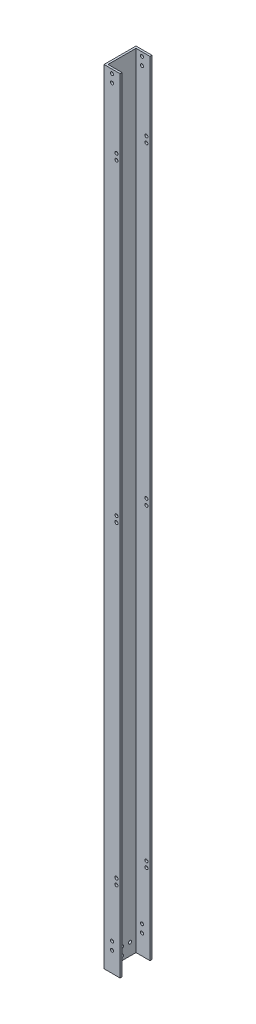
ISO-10303-21;
HEADER;
FILE_DESCRIPTION(('STEP AP214'),'2;1');
FILE_NAME('part.step','',(''),(''),'','','');
FILE_SCHEMA(('AUTOMOTIVE_DESIGN { 1 0 10303 214 1 1 1 1 }'));
ENDSEC;
DATA;
#1=APPLICATION_CONTEXT('core data for automotive mechanical design processes');
#2=APPLICATION_PROTOCOL_DEFINITION('international standard','automotive_design',2000,#1);
#3=PRODUCT_CONTEXT('',#1,'mechanical');
#4=PRODUCT('Part','Part','',(#3));
#5=PRODUCT_RELATED_PRODUCT_CATEGORY('part','',(#4));
#6=PRODUCT_DEFINITION_FORMATION('','',#4);
#7=PRODUCT_DEFINITION_CONTEXT('part definition',#1,'design');
#8=PRODUCT_DEFINITION('design','',#6,#7);
#9=PRODUCT_DEFINITION_SHAPE('','',#8);
#10=(LENGTH_UNIT() NAMED_UNIT(*) SI_UNIT(.MILLI.,.METRE.));
#11=(NAMED_UNIT(*) PLANE_ANGLE_UNIT() SI_UNIT($,.RADIAN.));
#12=(NAMED_UNIT(*) SI_UNIT($,.STERADIAN.) SOLID_ANGLE_UNIT());
#13=UNCERTAINTY_MEASURE_WITH_UNIT(LENGTH_MEASURE(1.E-05),#10,'distance_accuracy_value','');
#14=(GEOMETRIC_REPRESENTATION_CONTEXT(3) GLOBAL_UNCERTAINTY_ASSIGNED_CONTEXT((#13)) GLOBAL_UNIT_ASSIGNED_CONTEXT((#10,
#11,#12)) REPRESENTATION_CONTEXT('',''));
#15=CARTESIAN_POINT('',(0.,0.,0.));
#16=DIRECTION('',(0.,0.,1.));
#17=DIRECTION('',(1.,0.,0.));
#18=AXIS2_PLACEMENT_3D('',#15,#16,#17);
#19=CARTESIAN_POINT('',(25.4,1244.6,0.));
#20=DIRECTION('',(-1.,0.,0.));
#21=DIRECTION('',(0.,0.,1.));
#22=AXIS2_PLACEMENT_3D('',#19,#20,#21);
#23=PLANE('',#22);
#24=DIRECTION('',(0.,0.,-1.));
#25=VECTOR('',#24,1.);
#26=CARTESIAN_POINT('',(25.4,1244.6,0.));
#27=LINE('',#26,#25);
#28=CARTESIAN_POINT('',(25.4,1244.6,-47.625));
#29=VERTEX_POINT('',#28);
#30=CARTESIAN_POINT('',(25.4,1244.6,-50.8));
#31=VERTEX_POINT('',#30);
#32=EDGE_CURVE('E329',#29,#31,#27,.T.);
#33=ORIENTED_EDGE('',*,*,#32,.F.);
#34=DIRECTION('',(0.,1.,0.));
#35=VECTOR('',#34,1.);
#36=CARTESIAN_POINT('',(25.4,0.,-47.625));
#37=LINE('',#36,#35);
#38=CARTESIAN_POINT('',(25.4,0.,-47.625));
#39=VERTEX_POINT('',#38);
#40=EDGE_CURVE('E152',#39,#29,#37,.T.);
#41=ORIENTED_EDGE('',*,*,#40,.F.);
#42=DIRECTION('',(0.,0.,-1.));
#43=VECTOR('',#42,1.);
#44=CARTESIAN_POINT('',(25.4,0.,0.));
#45=LINE('',#44,#43);
#46=CARTESIAN_POINT('',(25.4,0.,-50.8));
#47=VERTEX_POINT('',#46);
#48=EDGE_CURVE('E157',#39,#47,#45,.T.);
#49=ORIENTED_EDGE('',*,*,#48,.T.);
#50=DIRECTION('',(0.,-1.,0.));
#51=VECTOR('',#50,1.);
#52=CARTESIAN_POINT('',(25.4,1244.6,-50.8));
#53=LINE('',#52,#51);
#54=EDGE_CURVE('E167',#31,#47,#53,.T.);
#55=ORIENTED_EDGE('',*,*,#54,.F.);
#56=EDGE_LOOP('',(#33,#41,#49,#55));
#57=FACE_BOUND('',#56,.T.);
#58=ADVANCED_FACE('F56',(#57),#23,.F.);
#59=CARTESIAN_POINT('',(0.,1244.6,0.));
#60=DIRECTION('',(0.,1.,0.));
#61=DIRECTION('',(0.,0.,1.));
#62=AXIS2_PLACEMENT_3D('',#59,#60,#61);
#63=PLANE('',#62);
#64=DIRECTION('',(-1.,0.,0.));
#65=VECTOR('',#64,1.);
#66=CARTESIAN_POINT('',(0.,1244.6,-47.625));
#67=LINE('',#66,#65);
#68=CARTESIAN_POINT('',(3.175,1244.6,-47.625));
#69=VERTEX_POINT('',#68);
#70=EDGE_CURVE('E318',#29,#69,#67,.T.);
#71=ORIENTED_EDGE('',*,*,#70,.F.);
#72=ORIENTED_EDGE('',*,*,#32,.T.);
#73=DIRECTION('',(-1.,0.,0.));
#74=VECTOR('',#73,1.);
#75=CARTESIAN_POINT('',(0.,1244.6,-50.8));
#76=LINE('',#75,#74);
#77=CARTESIAN_POINT('',(0.,1244.6,-50.8));
#78=VERTEX_POINT('',#77);
#79=EDGE_CURVE('E82',#31,#78,#76,.T.);
#80=ORIENTED_EDGE('',*,*,#79,.T.);
#81=DIRECTION('',(0.,0.,1.));
#82=VECTOR('',#81,1.);
#83=CARTESIAN_POINT('',(0.,1244.6,0.));
#84=LINE('',#83,#82);
#85=CARTESIAN_POINT('',(0.,1244.6,0.));
#86=VERTEX_POINT('',#85);
#87=EDGE_CURVE('E159',#78,#86,#84,.T.);
#88=ORIENTED_EDGE('',*,*,#87,.T.);
#89=DIRECTION('',(1.,0.,0.));
#90=VECTOR('',#89,1.);
#91=CARTESIAN_POINT('',(0.,1244.6,0.));
#92=LINE('',#91,#90);
#93=CARTESIAN_POINT('',(25.4,1244.6,0.));
#94=VERTEX_POINT('',#93);
#95=EDGE_CURVE('E110',#86,#94,#92,.T.);
#96=ORIENTED_EDGE('',*,*,#95,.T.);
#97=CARTESIAN_POINT('',(25.4,1244.6,-3.175));
#98=VERTEX_POINT('',#97);
#99=EDGE_CURVE('E330',#94,#98,#27,.T.);
#100=ORIENTED_EDGE('',*,*,#99,.T.);
#101=DIRECTION('',(1.,0.,0.));
#102=VECTOR('',#101,1.);
#103=CARTESIAN_POINT('',(0.,1244.6,-3.175));
#104=LINE('',#103,#102);
#105=CARTESIAN_POINT('',(3.175,1244.6,-3.175));
#106=VERTEX_POINT('',#105);
#107=EDGE_CURVE('E148',#106,#98,#104,.T.);
#108=ORIENTED_EDGE('',*,*,#107,.F.);
#109=DIRECTION('',(0.,0.,1.));
#110=VECTOR('',#109,1.);
#111=CARTESIAN_POINT('',(3.175,1244.6,0.));
#112=LINE('',#111,#110);
#113=EDGE_CURVE('E315',#69,#106,#112,.T.);
#114=ORIENTED_EDGE('',*,*,#113,.F.);
#115=EDGE_LOOP('',(#71,#72,#80,#88,#96,#100,#108,#114));
#116=FACE_BOUND('',#115,.T.);
#117=ADVANCED_FACE('F343',(#116),#63,.T.);
#118=CARTESIAN_POINT('',(0.,0.,0.));
#119=DIRECTION('',(0.,1.,0.));
#120=DIRECTION('',(0.,0.,1.));
#121=AXIS2_PLACEMENT_3D('',#118,#119,#120);
#122=PLANE('',#121);
#123=ORIENTED_EDGE('',*,*,#48,.F.);
#124=DIRECTION('',(-1.,0.,0.));
#125=VECTOR('',#124,1.);
#126=CARTESIAN_POINT('',(0.,0.,-47.625));
#127=LINE('',#126,#125);
#128=CARTESIAN_POINT('',(3.175,0.,-47.625));
#129=VERTEX_POINT('',#128);
#130=EDGE_CURVE('E142',#39,#129,#127,.T.);
#131=ORIENTED_EDGE('',*,*,#130,.T.);
#132=DIRECTION('',(0.,0.,1.));
#133=VECTOR('',#132,1.);
#134=CARTESIAN_POINT('',(3.175,0.,0.));
#135=LINE('',#134,#133);
#136=CARTESIAN_POINT('',(3.175,0.,-3.175));
#137=VERTEX_POINT('',#136);
#138=EDGE_CURVE('E73',#129,#137,#135,.T.);
#139=ORIENTED_EDGE('',*,*,#138,.T.);
#140=DIRECTION('',(1.,0.,0.));
#141=VECTOR('',#140,1.);
#142=CARTESIAN_POINT('',(0.,0.,-3.175));
#143=LINE('',#142,#141);
#144=CARTESIAN_POINT('',(25.4,0.,-3.175));
#145=VERTEX_POINT('',#144);
#146=EDGE_CURVE('E133',#137,#145,#143,.T.);
#147=ORIENTED_EDGE('',*,*,#146,.T.);
#148=CARTESIAN_POINT('',(25.4,0.,0.));
#149=VERTEX_POINT('',#148);
#150=EDGE_CURVE('E138',#149,#145,#45,.T.);
#151=ORIENTED_EDGE('',*,*,#150,.F.);
#152=DIRECTION('',(1.,0.,0.));
#153=VECTOR('',#152,1.);
#154=CARTESIAN_POINT('',(0.,0.,0.));
#155=LINE('',#154,#153);
#156=CARTESIAN_POINT('',(0.,0.,0.));
#157=VERTEX_POINT('',#156);
#158=EDGE_CURVE('E161',#157,#149,#155,.T.);
#159=ORIENTED_EDGE('',*,*,#158,.F.);
#160=DIRECTION('',(0.,0.,1.));
#161=VECTOR('',#160,1.);
#162=CARTESIAN_POINT('',(0.,0.,0.));
#163=LINE('',#162,#161);
#164=CARTESIAN_POINT('',(0.,0.,-50.8));
#165=VERTEX_POINT('',#164);
#166=EDGE_CURVE('E326',#165,#157,#163,.T.);
#167=ORIENTED_EDGE('',*,*,#166,.F.);
#168=DIRECTION('',(-1.,0.,0.));
#169=VECTOR('',#168,1.);
#170=CARTESIAN_POINT('',(0.,0.,-50.8));
#171=LINE('',#170,#169);
#172=EDGE_CURVE('E103',#47,#165,#171,.T.);
#173=ORIENTED_EDGE('',*,*,#172,.F.);
#174=EDGE_LOOP('',(#123,#131,#139,#147,#151,#159,#167,#173));
#175=FACE_BOUND('',#174,.T.);
#176=ADVANCED_FACE('F136',(#175),#122,.F.);
#177=CARTESIAN_POINT('',(0.,1244.6,0.));
#178=DIRECTION('',(1.,0.,0.));
#179=DIRECTION('',(0.,0.,-1.));
#180=AXIS2_PLACEMENT_3D('',#177,#178,#179);
#181=PLANE('',#180);
#182=CARTESIAN_POINT('',(0.,19.05,-12.7000000000056));
#183=DIRECTION('',(-1.,0.,0.));
#184=DIRECTION('',(0.,0.,1.));
#185=AXIS2_PLACEMENT_3D('',#182,#183,#184);
#186=CIRCLE('',#185,2.48919999999998);
#187=CARTESIAN_POINT('',(0.,19.05,-10.2108000000057));
#188=VERTEX_POINT('',#187);
#189=EDGE_CURVE('E302',#188,#188,#186,.T.);
#190=ORIENTED_EDGE('',*,*,#189,.F.);
#191=EDGE_LOOP('',(#190));
#192=FACE_BOUND('',#191,.T.);
#193=CARTESIAN_POINT('',(0.,19.0499999999999,-38.1000000000057));
#194=DIRECTION('',(-1.,0.,0.));
#195=DIRECTION('',(0.,0.,1.));
#196=AXIS2_PLACEMENT_3D('',#193,#194,#195);
#197=CIRCLE('',#196,2.4892);
#198=CARTESIAN_POINT('',(0.,19.0499999999999,-35.6108000000056));
#199=VERTEX_POINT('',#198);
#200=EDGE_CURVE('E306',#199,#199,#197,.T.);
#201=ORIENTED_EDGE('',*,*,#200,.F.);
#202=EDGE_LOOP('',(#201));
#203=FACE_BOUND('',#202,.T.);
#204=CARTESIAN_POINT('',(0.,6.34999999999994,-25.4000000000056));
#205=DIRECTION('',(-1.,0.,0.));
#206=DIRECTION('',(0.,0.,1.));
#207=AXIS2_PLACEMENT_3D('',#204,#205,#206);
#208=CIRCLE('',#207,2.4892);
#209=CARTESIAN_POINT('',(0.,6.34999999999994,-22.9108000000056));
#210=VERTEX_POINT('',#209);
#211=EDGE_CURVE('E303',#210,#210,#208,.T.);
#212=ORIENTED_EDGE('',*,*,#211,.F.);
#213=EDGE_LOOP('',(#212));
#214=FACE_BOUND('',#213,.T.);
#215=CARTESIAN_POINT('',(0.,19.0499999999999,-25.4000000000056));
#216=DIRECTION('',(-1.,0.,0.));
#217=DIRECTION('',(0.,0.,1.));
#218=AXIS2_PLACEMENT_3D('',#215,#216,#217);
#219=CIRCLE('',#218,2.4892);
#220=CARTESIAN_POINT('',(0.,19.0499999999999,-22.9108000000056));
#221=VERTEX_POINT('',#220);
#222=EDGE_CURVE('E174',#221,#221,#219,.T.);
#223=ORIENTED_EDGE('',*,*,#222,.F.);
#224=EDGE_LOOP('',(#223));
#225=FACE_BOUND('',#224,.T.);
#226=ORIENTED_EDGE('',*,*,#166,.T.);
#227=DIRECTION('',(0.,-1.,0.));
#228=VECTOR('',#227,1.);
#229=CARTESIAN_POINT('',(0.,1244.6,0.));
#230=LINE('',#229,#228);
#231=EDGE_CURVE('E12',#86,#157,#230,.T.);
#232=ORIENTED_EDGE('',*,*,#231,.F.);
#233=ORIENTED_EDGE('',*,*,#87,.F.);
#234=DIRECTION('',(0.,-1.,0.));
#235=VECTOR('',#234,1.);
#236=CARTESIAN_POINT('',(0.,1244.6,-50.8));
#237=LINE('',#236,#235);
#238=EDGE_CURVE('E165',#78,#165,#237,.T.);
#239=ORIENTED_EDGE('',*,*,#238,.T.);
#240=EDGE_LOOP('',(#226,#232,#233,#239));
#241=FACE_BOUND('',#240,.T.);
#242=ADVANCED_FACE('F58',(#192,#203,#214,#225,#241),#181,.F.);
#243=CARTESIAN_POINT('',(0.,1244.6,0.));
#244=DIRECTION('',(0.,0.,-1.));
#245=DIRECTION('',(-1.,0.,0.));
#246=AXIS2_PLACEMENT_3D('',#243,#244,#245);
#247=PLANE('',#246);
#248=CARTESIAN_POINT('',(19.6850000000001,633.4125,0.));
#249=DIRECTION('',(0.,0.,-1.));
#250=DIRECTION('',(-1.,0.,0.));
#251=AXIS2_PLACEMENT_3D('',#248,#249,#250);
#252=CIRCLE('',#251,2.48919999999993);
#253=CARTESIAN_POINT('',(17.1958000000002,633.4125,0.));
#254=VERTEX_POINT('',#253);
#255=EDGE_CURVE('E221',#254,#254,#252,.T.);
#256=ORIENTED_EDGE('',*,*,#255,.T.);
#257=EDGE_LOOP('',(#256));
#258=FACE_BOUND('',#257,.T.);
#259=CARTESIAN_POINT('',(19.6850000000001,623.8875,0.));
#260=DIRECTION('',(0.,0.,-1.));
#261=DIRECTION('',(-1.,0.,0.));
#262=AXIS2_PLACEMENT_3D('',#259,#260,#261);
#263=CIRCLE('',#262,2.48919999999994);
#264=CARTESIAN_POINT('',(17.1958000000002,623.8875,0.));
#265=VERTEX_POINT('',#264);
#266=EDGE_CURVE('E232',#265,#265,#263,.T.);
#267=ORIENTED_EDGE('',*,*,#266,.T.);
#268=EDGE_LOOP('',(#267));
#269=FACE_BOUND('',#268,.T.);
#270=CARTESIAN_POINT('',(19.6850000000006,1132.205,0.));
#271=DIRECTION('',(0.,0.,-1.));
#272=DIRECTION('',(-1.,0.,0.));
#273=AXIS2_PLACEMENT_3D('',#270,#271,#272);
#274=CIRCLE('',#273,2.48919999999847);
#275=CARTESIAN_POINT('',(17.1958000000022,1132.205,0.));
#276=VERTEX_POINT('',#275);
#277=EDGE_CURVE('E268',#276,#276,#274,.T.);
#278=ORIENTED_EDGE('',*,*,#277,.T.);
#279=EDGE_LOOP('',(#278));
#280=FACE_BOUND('',#279,.T.);
#281=CARTESIAN_POINT('',(19.6850000000001,134.62,0.));
#282=DIRECTION('',(0.,0.,-1.));
#283=DIRECTION('',(-1.,0.,0.));
#284=AXIS2_PLACEMENT_3D('',#281,#282,#283);
#285=CIRCLE('',#284,2.48920000000062);
#286=CARTESIAN_POINT('',(17.1957999999994,134.62,0.));
#287=VERTEX_POINT('',#286);
#288=EDGE_CURVE('E217',#287,#287,#285,.T.);
#289=ORIENTED_EDGE('',*,*,#288,.T.);
#290=EDGE_LOOP('',(#289));
#291=FACE_BOUND('',#290,.T.);
#292=CARTESIAN_POINT('',(19.6850000000001,125.095,0.));
#293=DIRECTION('',(0.,0.,-1.));
#294=DIRECTION('',(-1.,0.,0.));
#295=AXIS2_PLACEMENT_3D('',#292,#293,#294);
#296=CIRCLE('',#295,2.4891999999997);
#297=CARTESIAN_POINT('',(17.1958000000004,125.095,0.));
#298=VERTEX_POINT('',#297);
#299=EDGE_CURVE('E213',#298,#298,#296,.T.);
#300=ORIENTED_EDGE('',*,*,#299,.T.);
#301=EDGE_LOOP('',(#300));
#302=FACE_BOUND('',#301,.T.);
#303=CARTESIAN_POINT('',(19.6850000000006,1122.68,0.));
#304=DIRECTION('',(0.,0.,-1.));
#305=DIRECTION('',(-1.,0.,0.));
#306=AXIS2_PLACEMENT_3D('',#303,#304,#305);
#307=CIRCLE('',#306,2.48919999999847);
#308=CARTESIAN_POINT('',(17.1958000000022,1122.68,0.));
#309=VERTEX_POINT('',#308);
#310=EDGE_CURVE('E208',#309,#309,#307,.T.);
#311=ORIENTED_EDGE('',*,*,#310,.T.);
#312=EDGE_LOOP('',(#311));
#313=FACE_BOUND('',#312,.T.);
#314=CARTESIAN_POINT('',(12.7000000000001,31.75,0.));
#315=DIRECTION('',(0.,0.,1.));
#316=DIRECTION('',(1.,0.,0.));
#317=AXIS2_PLACEMENT_3D('',#314,#315,#316);
#318=CIRCLE('',#317,2.4892);
#319=CARTESIAN_POINT('',(15.1892000000001,31.75,0.));
#320=VERTEX_POINT('',#319);
#321=EDGE_CURVE('E282',#320,#320,#318,.T.);
#322=ORIENTED_EDGE('',*,*,#321,.F.);
#323=EDGE_LOOP('',(#322));
#324=FACE_BOUND('',#323,.T.);
#325=CARTESIAN_POINT('',(12.7,1238.25,0.));
#326=DIRECTION('',(0.,0.,1.));
#327=DIRECTION('',(1.,0.,0.));
#328=AXIS2_PLACEMENT_3D('',#325,#326,#327);
#329=CIRCLE('',#328,2.48920000000005);
#330=CARTESIAN_POINT('',(15.1892000000001,1238.25,0.));
#331=VERTEX_POINT('',#330);
#332=EDGE_CURVE('E275',#331,#331,#329,.T.);
#333=ORIENTED_EDGE('',*,*,#332,.F.);
#334=EDGE_LOOP('',(#333));
#335=FACE_BOUND('',#334,.T.);
#336=CARTESIAN_POINT('',(12.7,1225.55,0.));
#337=DIRECTION('',(0.,0.,1.));
#338=DIRECTION('',(1.,0.,0.));
#339=AXIS2_PLACEMENT_3D('',#336,#337,#338);
#340=CIRCLE('',#339,2.48920000000004);
#341=CARTESIAN_POINT('',(15.1892,1225.55,0.));
#342=VERTEX_POINT('',#341);
#343=EDGE_CURVE('E271',#342,#342,#340,.T.);
#344=ORIENTED_EDGE('',*,*,#343,.F.);
#345=EDGE_LOOP('',(#344));
#346=FACE_BOUND('',#345,.T.);
#347=CARTESIAN_POINT('',(12.7,44.45,0.));
#348=DIRECTION('',(0.,0.,1.));
#349=DIRECTION('',(1.,0.,0.));
#350=AXIS2_PLACEMENT_3D('',#347,#348,#349);
#351=CIRCLE('',#350,2.4892);
#352=CARTESIAN_POINT('',(15.1892,44.45,0.));
#353=VERTEX_POINT('',#352);
#354=EDGE_CURVE('E281',#353,#353,#351,.T.);
#355=ORIENTED_EDGE('',*,*,#354,.F.);
#356=EDGE_LOOP('',(#355));
#357=FACE_BOUND('',#356,.T.);
#358=ORIENTED_EDGE('',*,*,#158,.T.);
#359=DIRECTION('',(0.,-1.,0.));
#360=VECTOR('',#359,1.);
#361=CARTESIAN_POINT('',(25.4,1244.6,0.));
#362=LINE('',#361,#360);
#363=EDGE_CURVE('E65',#94,#149,#362,.T.);
#364=ORIENTED_EDGE('',*,*,#363,.F.);
#365=ORIENTED_EDGE('',*,*,#95,.F.);
#366=ORIENTED_EDGE('',*,*,#231,.T.);
#367=EDGE_LOOP('',(#358,#364,#365,#366));
#368=FACE_BOUND('',#367,.T.);
#369=ADVANCED_FACE('F336',(#258,#269,#280,#291,#302,#313,#324,#335,#346,#357,#368),#247,.F.);
#370=ORIENTED_EDGE('',*,*,#150,.T.);
#371=DIRECTION('',(0.,1.,0.));
#372=VECTOR('',#371,1.);
#373=CARTESIAN_POINT('',(25.4,0.,-3.175));
#374=LINE('',#373,#372);
#375=EDGE_CURVE('E145',#145,#98,#374,.T.);
#376=ORIENTED_EDGE('',*,*,#375,.T.);
#377=ORIENTED_EDGE('',*,*,#99,.F.);
#378=ORIENTED_EDGE('',*,*,#363,.T.);
#379=EDGE_LOOP('',(#370,#376,#377,#378));
#380=FACE_BOUND('',#379,.T.);
#381=ADVANCED_FACE('F156',(#380),#23,.F.);
#382=CARTESIAN_POINT('',(0.,1244.6,-50.8));
#383=DIRECTION('',(0.,0.,1.));
#384=DIRECTION('',(1.,0.,0.));
#385=AXIS2_PLACEMENT_3D('',#382,#383,#384);
#386=PLANE('',#385);
#387=CARTESIAN_POINT('',(19.6850000000001,633.4125,-50.8));
#388=DIRECTION('',(0.,0.,-1.));
#389=DIRECTION('',(-1.,0.,0.));
#390=AXIS2_PLACEMENT_3D('',#387,#388,#389);
#391=CIRCLE('',#390,2.48919999999993);
#392=CARTESIAN_POINT('',(17.1958000000002,633.4125,-50.8));
#393=VERTEX_POINT('',#392);
#394=EDGE_CURVE('E227',#393,#393,#391,.T.);
#395=ORIENTED_EDGE('',*,*,#394,.F.);
#396=EDGE_LOOP('',(#395));
#397=FACE_BOUND('',#396,.T.);
#398=CARTESIAN_POINT('',(19.6850000000001,623.8875,-50.8));
#399=DIRECTION('',(0.,0.,-1.));
#400=DIRECTION('',(-1.,0.,0.));
#401=AXIS2_PLACEMENT_3D('',#398,#399,#400);
#402=CIRCLE('',#401,2.48919999999994);
#403=CARTESIAN_POINT('',(17.1958000000002,623.8875,-50.8));
#404=VERTEX_POINT('',#403);
#405=EDGE_CURVE('E237',#404,#404,#402,.T.);
#406=ORIENTED_EDGE('',*,*,#405,.F.);
#407=EDGE_LOOP('',(#406));
#408=FACE_BOUND('',#407,.T.);
#409=CARTESIAN_POINT('',(19.6850000000006,1132.205,-50.8));
#410=DIRECTION('',(0.,0.,1.));
#411=DIRECTION('',(1.,0.,0.));
#412=AXIS2_PLACEMENT_3D('',#409,#410,#411);
#413=CIRCLE('',#412,2.48919999999847);
#414=CARTESIAN_POINT('',(22.1741999999991,1132.205,-50.8));
#415=VERTEX_POINT('',#414);
#416=EDGE_CURVE('E203',#415,#415,#413,.T.);
#417=ORIENTED_EDGE('',*,*,#416,.T.);
#418=EDGE_LOOP('',(#417));
#419=FACE_BOUND('',#418,.T.);
#420=CARTESIAN_POINT('',(19.6850000000001,134.62,-50.8));
#421=DIRECTION('',(0.,0.,1.));
#422=DIRECTION('',(1.,0.,0.));
#423=AXIS2_PLACEMENT_3D('',#420,#421,#422);
#424=CIRCLE('',#423,2.48920000000062);
#425=CARTESIAN_POINT('',(22.1742000000007,134.62,-50.8));
#426=VERTEX_POINT('',#425);
#427=EDGE_CURVE('E246',#426,#426,#424,.T.);
#428=ORIENTED_EDGE('',*,*,#427,.T.);
#429=EDGE_LOOP('',(#428));
#430=FACE_BOUND('',#429,.T.);
#431=CARTESIAN_POINT('',(19.6850000000001,125.095,-50.8));
#432=DIRECTION('',(0.,0.,1.));
#433=DIRECTION('',(1.,0.,0.));
#434=AXIS2_PLACEMENT_3D('',#431,#432,#433);
#435=CIRCLE('',#434,2.4891999999997);
#436=CARTESIAN_POINT('',(22.1741999999998,125.095,-50.8));
#437=VERTEX_POINT('',#436);
#438=EDGE_CURVE('E249',#437,#437,#435,.T.);
#439=ORIENTED_EDGE('',*,*,#438,.T.);
#440=EDGE_LOOP('',(#439));
#441=FACE_BOUND('',#440,.T.);
#442=CARTESIAN_POINT('',(19.6850000000006,1122.68,-50.8));
#443=DIRECTION('',(0.,0.,1.));
#444=DIRECTION('',(1.,0.,0.));
#445=AXIS2_PLACEMENT_3D('',#442,#443,#444);
#446=CIRCLE('',#445,2.48919999999847);
#447=CARTESIAN_POINT('',(22.1741999999991,1122.68,-50.8));
#448=VERTEX_POINT('',#447);
#449=EDGE_CURVE('E243',#448,#448,#446,.T.);
#450=ORIENTED_EDGE('',*,*,#449,.T.);
#451=EDGE_LOOP('',(#450));
#452=FACE_BOUND('',#451,.T.);
#453=CARTESIAN_POINT('',(12.7000000000001,31.75,-50.8));
#454=DIRECTION('',(0.,0.,1.));
#455=DIRECTION('',(1.,0.,0.));
#456=AXIS2_PLACEMENT_3D('',#453,#454,#455);
#457=CIRCLE('',#456,2.4892);
#458=CARTESIAN_POINT('',(15.1892000000001,31.75,-50.8));
#459=VERTEX_POINT('',#458);
#460=EDGE_CURVE('E278',#459,#459,#457,.T.);
#461=ORIENTED_EDGE('',*,*,#460,.T.);
#462=EDGE_LOOP('',(#461));
#463=FACE_BOUND('',#462,.T.);
#464=CARTESIAN_POINT('',(12.7,1238.25,-50.8));
#465=DIRECTION('',(0.,0.,1.));
#466=DIRECTION('',(1.,0.,0.));
#467=AXIS2_PLACEMENT_3D('',#464,#465,#466);
#468=CIRCLE('',#467,2.48920000000005);
#469=CARTESIAN_POINT('',(15.1892000000001,1238.25,-50.8));
#470=VERTEX_POINT('',#469);
#471=EDGE_CURVE('E285',#470,#470,#468,.T.);
#472=ORIENTED_EDGE('',*,*,#471,.T.);
#473=EDGE_LOOP('',(#472));
#474=FACE_BOUND('',#473,.T.);
#475=CARTESIAN_POINT('',(12.7,1225.55,-50.8));
#476=DIRECTION('',(0.,0.,1.));
#477=DIRECTION('',(1.,0.,0.));
#478=AXIS2_PLACEMENT_3D('',#475,#476,#477);
#479=CIRCLE('',#478,2.48920000000004);
#480=CARTESIAN_POINT('',(15.1892,1225.55,-50.8));
#481=VERTEX_POINT('',#480);
#482=EDGE_CURVE('E272',#481,#481,#479,.T.);
#483=ORIENTED_EDGE('',*,*,#482,.T.);
#484=EDGE_LOOP('',(#483));
#485=FACE_BOUND('',#484,.T.);
#486=CARTESIAN_POINT('',(12.7,44.45,-50.8));
#487=DIRECTION('',(0.,0.,1.));
#488=DIRECTION('',(1.,0.,0.));
#489=AXIS2_PLACEMENT_3D('',#486,#487,#488);
#490=CIRCLE('',#489,2.4892);
#491=CARTESIAN_POINT('',(15.1892,44.45,-50.8));
#492=VERTEX_POINT('',#491);
#493=EDGE_CURVE('E186',#492,#492,#490,.T.);
#494=ORIENTED_EDGE('',*,*,#493,.T.);
#495=EDGE_LOOP('',(#494));
#496=FACE_BOUND('',#495,.T.);
#497=ORIENTED_EDGE('',*,*,#172,.T.);
#498=ORIENTED_EDGE('',*,*,#238,.F.);
#499=ORIENTED_EDGE('',*,*,#79,.F.);
#500=ORIENTED_EDGE('',*,*,#54,.T.);
#501=EDGE_LOOP('',(#497,#498,#499,#500));
#502=FACE_BOUND('',#501,.T.);
#503=ADVANCED_FACE('F341',(#397,#408,#419,#430,#441,#452,#463,#474,#485,#496,#502),#386,.F.);
#504=CARTESIAN_POINT('',(3.175,1244.6,0.));
#505=DIRECTION('',(1.,0.,0.));
#506=DIRECTION('',(0.,0.,-1.));
#507=AXIS2_PLACEMENT_3D('',#504,#505,#506);
#508=PLANE('',#507);
#509=CARTESIAN_POINT('',(3.175,19.05,-12.7000000000056));
#510=DIRECTION('',(1.,0.,0.));
#511=DIRECTION('',(0.,0.,-1.));
#512=AXIS2_PLACEMENT_3D('',#509,#510,#511);
#513=CIRCLE('',#512,2.48919999999998);
#514=CARTESIAN_POINT('',(3.175,19.05,-15.1892000000056));
#515=VERTEX_POINT('',#514);
#516=EDGE_CURVE('E153',#515,#515,#513,.T.);
#517=ORIENTED_EDGE('',*,*,#516,.F.);
#518=EDGE_LOOP('',(#517));
#519=FACE_BOUND('',#518,.T.);
#520=CARTESIAN_POINT('',(3.175,19.0499999999999,-38.1000000000057));
#521=DIRECTION('',(1.,0.,0.));
#522=DIRECTION('',(0.,0.,-1.));
#523=AXIS2_PLACEMENT_3D('',#520,#521,#522);
#524=CIRCLE('',#523,2.4892);
#525=CARTESIAN_POINT('',(3.175,19.0499999999999,-40.5892000000057));
#526=VERTEX_POINT('',#525);
#527=EDGE_CURVE('E177',#526,#526,#524,.T.);
#528=ORIENTED_EDGE('',*,*,#527,.F.);
#529=EDGE_LOOP('',(#528));
#530=FACE_BOUND('',#529,.T.);
#531=CARTESIAN_POINT('',(3.175,6.34999999999994,-25.4000000000056));
#532=DIRECTION('',(1.,0.,0.));
#533=DIRECTION('',(0.,0.,-1.));
#534=AXIS2_PLACEMENT_3D('',#531,#532,#533);
#535=CIRCLE('',#534,2.4892);
#536=CARTESIAN_POINT('',(3.175,6.34999999999994,-27.8892000000056));
#537=VERTEX_POINT('',#536);
#538=EDGE_CURVE('E173',#537,#537,#535,.T.);
#539=ORIENTED_EDGE('',*,*,#538,.F.);
#540=EDGE_LOOP('',(#539));
#541=FACE_BOUND('',#540,.T.);
#542=CARTESIAN_POINT('',(3.175,19.0499999999999,-25.4000000000056));
#543=DIRECTION('',(1.,0.,0.));
#544=DIRECTION('',(0.,0.,-1.));
#545=AXIS2_PLACEMENT_3D('',#542,#543,#544);
#546=CIRCLE('',#545,2.4892);
#547=CARTESIAN_POINT('',(3.175,19.0499999999999,-27.8892000000056));
#548=VERTEX_POINT('',#547);
#549=EDGE_CURVE('E170',#548,#548,#546,.T.);
#550=ORIENTED_EDGE('',*,*,#549,.F.);
#551=EDGE_LOOP('',(#550));
#552=FACE_BOUND('',#551,.T.);
#553=ORIENTED_EDGE('',*,*,#138,.F.);
#554=DIRECTION('',(0.,-1.,0.));
#555=VECTOR('',#554,1.);
#556=CARTESIAN_POINT('',(3.175,1244.6,-47.625));
#557=LINE('',#556,#555);
#558=EDGE_CURVE('E320',#69,#129,#557,.T.);
#559=ORIENTED_EDGE('',*,*,#558,.F.);
#560=ORIENTED_EDGE('',*,*,#113,.T.);
#561=DIRECTION('',(0.,-1.,0.));
#562=VECTOR('',#561,1.);
#563=CARTESIAN_POINT('',(3.175,1244.6,-3.175));
#564=LINE('',#563,#562);
#565=EDGE_CURVE('E324',#106,#137,#564,.T.);
#566=ORIENTED_EDGE('',*,*,#565,.T.);
#567=EDGE_LOOP('',(#553,#559,#560,#566));
#568=FACE_BOUND('',#567,.T.);
#569=ADVANCED_FACE('F345',(#519,#530,#541,#552,#568),#508,.T.);
#570=CARTESIAN_POINT('',(0.,1244.6,-3.175));
#571=DIRECTION('',(0.,0.,-1.));
#572=DIRECTION('',(-1.,0.,0.));
#573=AXIS2_PLACEMENT_3D('',#570,#571,#572);
#574=PLANE('',#573);
#575=CARTESIAN_POINT('',(19.6850000000001,633.4125,-3.175));
#576=DIRECTION('',(0.,0.,-1.));
#577=DIRECTION('',(-1.,0.,0.));
#578=AXIS2_PLACEMENT_3D('',#575,#576,#577);
#579=CIRCLE('',#578,2.48919999999993);
#580=CARTESIAN_POINT('',(17.1958000000002,633.4125,-3.175));
#581=VERTEX_POINT('',#580);
#582=EDGE_CURVE('E240',#581,#581,#579,.T.);
#583=ORIENTED_EDGE('',*,*,#582,.F.);
#584=EDGE_LOOP('',(#583));
#585=FACE_BOUND('',#584,.T.);
#586=CARTESIAN_POINT('',(19.6850000000001,623.8875,-3.175));
#587=DIRECTION('',(0.,0.,-1.));
#588=DIRECTION('',(-1.,0.,0.));
#589=AXIS2_PLACEMENT_3D('',#586,#587,#588);
#590=CIRCLE('',#589,2.48919999999994);
#591=CARTESIAN_POINT('',(17.1958000000002,623.8875,-3.175));
#592=VERTEX_POINT('',#591);
#593=EDGE_CURVE('E220',#592,#592,#590,.T.);
#594=ORIENTED_EDGE('',*,*,#593,.F.);
#595=EDGE_LOOP('',(#594));
#596=FACE_BOUND('',#595,.T.);
#597=CARTESIAN_POINT('',(19.6850000000006,1132.205,-3.175));
#598=DIRECTION('',(0.,0.,-1.));
#599=DIRECTION('',(-1.,0.,0.));
#600=AXIS2_PLACEMENT_3D('',#597,#598,#599);
#601=CIRCLE('',#600,2.48919999999847);
#602=CARTESIAN_POINT('',(17.1958000000022,1132.205,-3.175));
#603=VERTEX_POINT('',#602);
#604=EDGE_CURVE('E216',#603,#603,#601,.T.);
#605=ORIENTED_EDGE('',*,*,#604,.F.);
#606=EDGE_LOOP('',(#605));
#607=FACE_BOUND('',#606,.T.);
#608=CARTESIAN_POINT('',(19.6850000000001,134.62,-3.175));
#609=DIRECTION('',(0.,0.,-1.));
#610=DIRECTION('',(-1.,0.,0.));
#611=AXIS2_PLACEMENT_3D('',#608,#609,#610);
#612=CIRCLE('',#611,2.48920000000062);
#613=CARTESIAN_POINT('',(17.1957999999994,134.62,-3.175));
#614=VERTEX_POINT('',#613);
#615=EDGE_CURVE('E212',#614,#614,#612,.T.);
#616=ORIENTED_EDGE('',*,*,#615,.F.);
#617=EDGE_LOOP('',(#616));
#618=FACE_BOUND('',#617,.T.);
#619=CARTESIAN_POINT('',(19.6850000000001,125.095,-3.175));
#620=DIRECTION('',(0.,0.,-1.));
#621=DIRECTION('',(-1.,0.,0.));
#622=AXIS2_PLACEMENT_3D('',#619,#620,#621);
#623=CIRCLE('',#622,2.4891999999997);
#624=CARTESIAN_POINT('',(17.1958000000004,125.095,-3.175));
#625=VERTEX_POINT('',#624);
#626=EDGE_CURVE('E207',#625,#625,#623,.T.);
#627=ORIENTED_EDGE('',*,*,#626,.F.);
#628=EDGE_LOOP('',(#627));
#629=FACE_BOUND('',#628,.T.);
#630=CARTESIAN_POINT('',(19.6850000000006,1122.68,-3.175));
#631=DIRECTION('',(0.,0.,-1.));
#632=DIRECTION('',(-1.,0.,0.));
#633=AXIS2_PLACEMENT_3D('',#630,#631,#632);
#634=CIRCLE('',#633,2.48919999999847);
#635=CARTESIAN_POINT('',(17.1958000000022,1122.68,-3.175));
#636=VERTEX_POINT('',#635);
#637=EDGE_CURVE('E202',#636,#636,#634,.T.);
#638=ORIENTED_EDGE('',*,*,#637,.F.);
#639=EDGE_LOOP('',(#638));
#640=FACE_BOUND('',#639,.T.);
#641=CARTESIAN_POINT('',(12.7000000000001,31.75,-3.175));
#642=DIRECTION('',(0.,0.,-1.));
#643=DIRECTION('',(-1.,0.,0.));
#644=AXIS2_PLACEMENT_3D('',#641,#642,#643);
#645=CIRCLE('',#644,2.4892);
#646=CARTESIAN_POINT('',(10.2108000000001,31.75,-3.175));
#647=VERTEX_POINT('',#646);
#648=EDGE_CURVE('E198',#647,#647,#645,.T.);
#649=ORIENTED_EDGE('',*,*,#648,.F.);
#650=EDGE_LOOP('',(#649));
#651=FACE_BOUND('',#650,.T.);
#652=CARTESIAN_POINT('',(12.7,1238.25,-3.175));
#653=DIRECTION('',(0.,0.,-1.));
#654=DIRECTION('',(-1.,0.,0.));
#655=AXIS2_PLACEMENT_3D('',#652,#653,#654);
#656=CIRCLE('',#655,2.48920000000005);
#657=CARTESIAN_POINT('',(10.2107999999999,1238.25,-3.175));
#658=VERTEX_POINT('',#657);
#659=EDGE_CURVE('E194',#658,#658,#656,.T.);
#660=ORIENTED_EDGE('',*,*,#659,.F.);
#661=EDGE_LOOP('',(#660));
#662=FACE_BOUND('',#661,.T.);
#663=CARTESIAN_POINT('',(12.7,1225.55,-3.175));
#664=DIRECTION('',(0.,0.,-1.));
#665=DIRECTION('',(-1.,0.,0.));
#666=AXIS2_PLACEMENT_3D('',#663,#664,#665);
#667=CIRCLE('',#666,2.48920000000004);
#668=CARTESIAN_POINT('',(10.2108,1225.55,-3.175));
#669=VERTEX_POINT('',#668);
#670=EDGE_CURVE('E190',#669,#669,#667,.T.);
#671=ORIENTED_EDGE('',*,*,#670,.F.);
#672=EDGE_LOOP('',(#671));
#673=FACE_BOUND('',#672,.T.);
#674=CARTESIAN_POINT('',(12.7,44.45,-3.175));
#675=DIRECTION('',(0.,0.,-1.));
#676=DIRECTION('',(-1.,0.,0.));
#677=AXIS2_PLACEMENT_3D('',#674,#675,#676);
#678=CIRCLE('',#677,2.4892);
#679=CARTESIAN_POINT('',(10.2108,44.45,-3.175));
#680=VERTEX_POINT('',#679);
#681=EDGE_CURVE('E185',#680,#680,#678,.T.);
#682=ORIENTED_EDGE('',*,*,#681,.F.);
#683=EDGE_LOOP('',(#682));
#684=FACE_BOUND('',#683,.T.);
#685=ORIENTED_EDGE('',*,*,#146,.F.);
#686=ORIENTED_EDGE('',*,*,#565,.F.);
#687=ORIENTED_EDGE('',*,*,#107,.T.);
#688=ORIENTED_EDGE('',*,*,#375,.F.);
#689=EDGE_LOOP('',(#685,#686,#687,#688));
#690=FACE_BOUND('',#689,.T.);
#691=ADVANCED_FACE('F146',(#585,#596,#607,#618,#629,#640,#651,#662,#673,#684,#690),#574,.T.);
#692=CARTESIAN_POINT('',(0.,1244.6,-47.625));
#693=DIRECTION('',(0.,0.,1.));
#694=DIRECTION('',(1.,0.,0.));
#695=AXIS2_PLACEMENT_3D('',#692,#693,#694);
#696=PLANE('',#695);
#697=CARTESIAN_POINT('',(19.6850000000001,633.4125,-47.625));
#698=DIRECTION('',(0.,0.,1.));
#699=DIRECTION('',(1.,0.,0.));
#700=AXIS2_PLACEMENT_3D('',#697,#698,#699);
#701=CIRCLE('',#700,2.48919999999993);
#702=CARTESIAN_POINT('',(22.1742,633.4125,-47.625));
#703=VERTEX_POINT('',#702);
#704=EDGE_CURVE('E60',#703,#703,#701,.T.);
#705=ORIENTED_EDGE('',*,*,#704,.F.);
#706=EDGE_LOOP('',(#705));
#707=FACE_BOUND('',#706,.T.);
#708=CARTESIAN_POINT('',(19.6850000000001,623.8875,-47.625));
#709=DIRECTION('',(0.,0.,1.));
#710=DIRECTION('',(1.,0.,0.));
#711=AXIS2_PLACEMENT_3D('',#708,#709,#710);
#712=CIRCLE('',#711,2.48919999999994);
#713=CARTESIAN_POINT('',(22.1742000000001,623.8875,-47.625));
#714=VERTEX_POINT('',#713);
#715=EDGE_CURVE('E218',#714,#714,#712,.T.);
#716=ORIENTED_EDGE('',*,*,#715,.F.);
#717=EDGE_LOOP('',(#716));
#718=FACE_BOUND('',#717,.T.);
#719=CARTESIAN_POINT('',(19.6850000000006,1132.205,-47.625));
#720=DIRECTION('',(0.,0.,1.));
#721=DIRECTION('',(1.,0.,0.));
#722=AXIS2_PLACEMENT_3D('',#719,#720,#721);
#723=CIRCLE('',#722,2.48919999999847);
#724=CARTESIAN_POINT('',(22.1741999999991,1132.205,-47.625));
#725=VERTEX_POINT('',#724);
#726=EDGE_CURVE('E214',#725,#725,#723,.T.);
#727=ORIENTED_EDGE('',*,*,#726,.F.);
#728=EDGE_LOOP('',(#727));
#729=FACE_BOUND('',#728,.T.);
#730=CARTESIAN_POINT('',(19.6850000000001,134.62,-47.625));
#731=DIRECTION('',(0.,0.,1.));
#732=DIRECTION('',(1.,0.,0.));
#733=AXIS2_PLACEMENT_3D('',#730,#731,#732);
#734=CIRCLE('',#733,2.48920000000062);
#735=CARTESIAN_POINT('',(22.1742000000007,134.62,-47.625));
#736=VERTEX_POINT('',#735);
#737=EDGE_CURVE('E209',#736,#736,#734,.T.);
#738=ORIENTED_EDGE('',*,*,#737,.F.);
#739=EDGE_LOOP('',(#738));
#740=FACE_BOUND('',#739,.T.);
#741=CARTESIAN_POINT('',(19.6850000000001,125.095,-47.625));
#742=DIRECTION('',(0.,0.,1.));
#743=DIRECTION('',(1.,0.,0.));
#744=AXIS2_PLACEMENT_3D('',#741,#742,#743);
#745=CIRCLE('',#744,2.4891999999997);
#746=CARTESIAN_POINT('',(22.1741999999998,125.095,-47.625));
#747=VERTEX_POINT('',#746);
#748=EDGE_CURVE('E204',#747,#747,#745,.T.);
#749=ORIENTED_EDGE('',*,*,#748,.F.);
#750=EDGE_LOOP('',(#749));
#751=FACE_BOUND('',#750,.T.);
#752=CARTESIAN_POINT('',(19.6850000000006,1122.68,-47.625));
#753=DIRECTION('',(0.,0.,1.));
#754=DIRECTION('',(1.,0.,0.));
#755=AXIS2_PLACEMENT_3D('',#752,#753,#754);
#756=CIRCLE('',#755,2.48919999999847);
#757=CARTESIAN_POINT('',(22.1741999999991,1122.68,-47.625));
#758=VERTEX_POINT('',#757);
#759=EDGE_CURVE('E199',#758,#758,#756,.T.);
#760=ORIENTED_EDGE('',*,*,#759,.F.);
#761=EDGE_LOOP('',(#760));
#762=FACE_BOUND('',#761,.T.);
#763=CARTESIAN_POINT('',(12.7000000000001,31.75,-47.625));
#764=DIRECTION('',(0.,0.,1.));
#765=DIRECTION('',(1.,0.,0.));
#766=AXIS2_PLACEMENT_3D('',#763,#764,#765);
#767=CIRCLE('',#766,2.4892);
#768=CARTESIAN_POINT('',(15.1892000000001,31.75,-47.625));
#769=VERTEX_POINT('',#768);
#770=EDGE_CURVE('E195',#769,#769,#767,.T.);
#771=ORIENTED_EDGE('',*,*,#770,.F.);
#772=EDGE_LOOP('',(#771));
#773=FACE_BOUND('',#772,.T.);
#774=CARTESIAN_POINT('',(12.7,1238.25,-47.625));
#775=DIRECTION('',(0.,0.,1.));
#776=DIRECTION('',(1.,0.,0.));
#777=AXIS2_PLACEMENT_3D('',#774,#775,#776);
#778=CIRCLE('',#777,2.48920000000005);
#779=CARTESIAN_POINT('',(15.1892000000001,1238.25,-47.625));
#780=VERTEX_POINT('',#779);
#781=EDGE_CURVE('E191',#780,#780,#778,.T.);
#782=ORIENTED_EDGE('',*,*,#781,.F.);
#783=EDGE_LOOP('',(#782));
#784=FACE_BOUND('',#783,.T.);
#785=CARTESIAN_POINT('',(12.7,1225.55,-47.625));
#786=DIRECTION('',(0.,0.,1.));
#787=DIRECTION('',(1.,0.,0.));
#788=AXIS2_PLACEMENT_3D('',#785,#786,#787);
#789=CIRCLE('',#788,2.48920000000004);
#790=CARTESIAN_POINT('',(15.1892,1225.55,-47.625));
#791=VERTEX_POINT('',#790);
#792=EDGE_CURVE('E187',#791,#791,#789,.T.);
#793=ORIENTED_EDGE('',*,*,#792,.F.);
#794=EDGE_LOOP('',(#793));
#795=FACE_BOUND('',#794,.T.);
#796=CARTESIAN_POINT('',(12.7,44.45,-47.625));
#797=DIRECTION('',(0.,0.,1.));
#798=DIRECTION('',(1.,0.,0.));
#799=AXIS2_PLACEMENT_3D('',#796,#797,#798);
#800=CIRCLE('',#799,2.4892);
#801=CARTESIAN_POINT('',(15.1892,44.45,-47.625));
#802=VERTEX_POINT('',#801);
#803=EDGE_CURVE('E182',#802,#802,#800,.T.);
#804=ORIENTED_EDGE('',*,*,#803,.F.);
#805=EDGE_LOOP('',(#804));
#806=FACE_BOUND('',#805,.T.);
#807=ORIENTED_EDGE('',*,*,#130,.F.);
#808=ORIENTED_EDGE('',*,*,#40,.T.);
#809=ORIENTED_EDGE('',*,*,#70,.T.);
#810=ORIENTED_EDGE('',*,*,#558,.T.);
#811=EDGE_LOOP('',(#807,#808,#809,#810));
#812=FACE_BOUND('',#811,.T.);
#813=ADVANCED_FACE('F347',(#707,#718,#729,#740,#751,#762,#773,#784,#795,#806,#812),#696,.T.);
#814=CARTESIAN_POINT('',(25.4,19.0499999999999,-25.4000000000056));
#815=DIRECTION('',(-1.,0.,0.));
#816=DIRECTION('',(0.,0.,1.));
#817=AXIS2_PLACEMENT_3D('',#814,#815,#816);
#818=CYLINDRICAL_SURFACE('',#817,2.4892);
#819=ORIENTED_EDGE('',*,*,#549,.T.);
#820=EDGE_LOOP('',(#819));
#821=FACE_BOUND('',#820,.T.);
#822=ORIENTED_EDGE('',*,*,#222,.T.);
#823=EDGE_LOOP('',(#822));
#824=FACE_BOUND('',#823,.T.);
#825=ADVANCED_FACE('F349',(#821,#824),#818,.F.);
#826=CARTESIAN_POINT('',(25.4,6.34999999999994,-25.4000000000056));
#827=DIRECTION('',(-1.,0.,0.));
#828=DIRECTION('',(0.,0.,1.));
#829=AXIS2_PLACEMENT_3D('',#826,#827,#828);
#830=CYLINDRICAL_SURFACE('',#829,2.4892);
#831=ORIENTED_EDGE('',*,*,#538,.T.);
#832=EDGE_LOOP('',(#831));
#833=FACE_BOUND('',#832,.T.);
#834=ORIENTED_EDGE('',*,*,#211,.T.);
#835=EDGE_LOOP('',(#834));
#836=FACE_BOUND('',#835,.T.);
#837=ADVANCED_FACE('F356',(#833,#836),#830,.F.);
#838=CARTESIAN_POINT('',(25.4,19.0499999999999,-38.1000000000057));
#839=DIRECTION('',(-1.,0.,0.));
#840=DIRECTION('',(0.,0.,1.));
#841=AXIS2_PLACEMENT_3D('',#838,#839,#840);
#842=CYLINDRICAL_SURFACE('',#841,2.4892);
#843=ORIENTED_EDGE('',*,*,#527,.T.);
#844=EDGE_LOOP('',(#843));
#845=FACE_BOUND('',#844,.T.);
#846=ORIENTED_EDGE('',*,*,#200,.T.);
#847=EDGE_LOOP('',(#846));
#848=FACE_BOUND('',#847,.T.);
#849=ADVANCED_FACE('F428',(#845,#848),#842,.F.);
#850=CARTESIAN_POINT('',(25.4,19.05,-12.7000000000056));
#851=DIRECTION('',(-1.,0.,0.));
#852=DIRECTION('',(0.,0.,1.));
#853=AXIS2_PLACEMENT_3D('',#850,#851,#852);
#854=CYLINDRICAL_SURFACE('',#853,2.48919999999998);
#855=ORIENTED_EDGE('',*,*,#516,.T.);
#856=EDGE_LOOP('',(#855));
#857=FACE_BOUND('',#856,.T.);
#858=ORIENTED_EDGE('',*,*,#189,.T.);
#859=EDGE_LOOP('',(#858));
#860=FACE_BOUND('',#859,.T.);
#861=ADVANCED_FACE('F421',(#857,#860),#854,.F.);
#862=CARTESIAN_POINT('',(12.7,44.45,-50.8));
#863=DIRECTION('',(0.,0.,1.));
#864=DIRECTION('',(1.,0.,0.));
#865=AXIS2_PLACEMENT_3D('',#862,#863,#864);
#866=CYLINDRICAL_SURFACE('',#865,2.4892);
#867=ORIENTED_EDGE('',*,*,#803,.T.);
#868=EDGE_LOOP('',(#867));
#869=FACE_BOUND('',#868,.T.);
#870=ORIENTED_EDGE('',*,*,#493,.F.);
#871=EDGE_LOOP('',(#870));
#872=FACE_BOUND('',#871,.T.);
#873=ADVANCED_FACE('F405',(#869,#872),#866,.F.);
#874=CARTESIAN_POINT('',(12.7,1225.55,-50.8));
#875=DIRECTION('',(0.,0.,1.));
#876=DIRECTION('',(1.,0.,0.));
#877=AXIS2_PLACEMENT_3D('',#874,#875,#876);
#878=CYLINDRICAL_SURFACE('',#877,2.48920000000004);
#879=ORIENTED_EDGE('',*,*,#792,.T.);
#880=EDGE_LOOP('',(#879));
#881=FACE_BOUND('',#880,.T.);
#882=ORIENTED_EDGE('',*,*,#482,.F.);
#883=EDGE_LOOP('',(#882));
#884=FACE_BOUND('',#883,.T.);
#885=ADVANCED_FACE('F413',(#881,#884),#878,.F.);
#886=CARTESIAN_POINT('',(12.7,1238.25,-50.8));
#887=DIRECTION('',(0.,0.,1.));
#888=DIRECTION('',(1.,0.,0.));
#889=AXIS2_PLACEMENT_3D('',#886,#887,#888);
#890=CYLINDRICAL_SURFACE('',#889,2.48920000000005);
#891=ORIENTED_EDGE('',*,*,#781,.T.);
#892=EDGE_LOOP('',(#891));
#893=FACE_BOUND('',#892,.T.);
#894=ORIENTED_EDGE('',*,*,#471,.F.);
#895=EDGE_LOOP('',(#894));
#896=FACE_BOUND('',#895,.T.);
#897=ADVANCED_FACE('F414',(#893,#896),#890,.F.);
#898=CARTESIAN_POINT('',(12.7000000000001,31.75,-50.8));
#899=DIRECTION('',(0.,0.,1.));
#900=DIRECTION('',(1.,0.,0.));
#901=AXIS2_PLACEMENT_3D('',#898,#899,#900);
#902=CYLINDRICAL_SURFACE('',#901,2.4892);
#903=ORIENTED_EDGE('',*,*,#770,.T.);
#904=EDGE_LOOP('',(#903));
#905=FACE_BOUND('',#904,.T.);
#906=ORIENTED_EDGE('',*,*,#460,.F.);
#907=EDGE_LOOP('',(#906));
#908=FACE_BOUND('',#907,.T.);
#909=ADVANCED_FACE('F402',(#905,#908),#902,.F.);
#910=ORIENTED_EDGE('',*,*,#681,.T.);
#911=EDGE_LOOP('',(#910));
#912=FACE_BOUND('',#911,.T.);
#913=ORIENTED_EDGE('',*,*,#354,.T.);
#914=EDGE_LOOP('',(#913));
#915=FACE_BOUND('',#914,.T.);
#916=ADVANCED_FACE('F399',(#912,#915),#866,.F.);
#917=ORIENTED_EDGE('',*,*,#670,.T.);
#918=EDGE_LOOP('',(#917));
#919=FACE_BOUND('',#918,.T.);
#920=ORIENTED_EDGE('',*,*,#343,.T.);
#921=EDGE_LOOP('',(#920));
#922=FACE_BOUND('',#921,.T.);
#923=ADVANCED_FACE('F401',(#919,#922),#878,.F.);
#924=ORIENTED_EDGE('',*,*,#659,.T.);
#925=EDGE_LOOP('',(#924));
#926=FACE_BOUND('',#925,.T.);
#927=ORIENTED_EDGE('',*,*,#332,.T.);
#928=EDGE_LOOP('',(#927));
#929=FACE_BOUND('',#928,.T.);
#930=ADVANCED_FACE('F410',(#926,#929),#890,.F.);
#931=ORIENTED_EDGE('',*,*,#648,.T.);
#932=EDGE_LOOP('',(#931));
#933=FACE_BOUND('',#932,.T.);
#934=ORIENTED_EDGE('',*,*,#321,.T.);
#935=EDGE_LOOP('',(#934));
#936=FACE_BOUND('',#935,.T.);
#937=ADVANCED_FACE('F417',(#933,#936),#902,.F.);
#938=CARTESIAN_POINT('',(19.6850000000006,1122.68,-50.8));
#939=DIRECTION('',(0.,0.,1.));
#940=DIRECTION('',(1.,0.,0.));
#941=AXIS2_PLACEMENT_3D('',#938,#939,#940);
#942=CYLINDRICAL_SURFACE('',#941,2.48919999999847);
#943=ORIENTED_EDGE('',*,*,#759,.T.);
#944=EDGE_LOOP('',(#943));
#945=FACE_BOUND('',#944,.T.);
#946=ORIENTED_EDGE('',*,*,#449,.F.);
#947=EDGE_LOOP('',(#946));
#948=FACE_BOUND('',#947,.T.);
#949=ADVANCED_FACE('F554',(#945,#948),#942,.F.);
#950=CARTESIAN_POINT('',(19.6850000000001,125.095,-50.8));
#951=DIRECTION('',(0.,0.,1.));
#952=DIRECTION('',(1.,0.,0.));
#953=AXIS2_PLACEMENT_3D('',#950,#951,#952);
#954=CYLINDRICAL_SURFACE('',#953,2.4891999999997);
#955=ORIENTED_EDGE('',*,*,#748,.T.);
#956=EDGE_LOOP('',(#955));
#957=FACE_BOUND('',#956,.T.);
#958=ORIENTED_EDGE('',*,*,#438,.F.);
#959=EDGE_LOOP('',(#958));
#960=FACE_BOUND('',#959,.T.);
#961=ADVANCED_FACE('F563',(#957,#960),#954,.F.);
#962=CARTESIAN_POINT('',(19.6850000000001,134.62,-50.8));
#963=DIRECTION('',(0.,0.,1.));
#964=DIRECTION('',(1.,0.,0.));
#965=AXIS2_PLACEMENT_3D('',#962,#963,#964);
#966=CYLINDRICAL_SURFACE('',#965,2.48920000000062);
#967=ORIENTED_EDGE('',*,*,#737,.T.);
#968=EDGE_LOOP('',(#967));
#969=FACE_BOUND('',#968,.T.);
#970=ORIENTED_EDGE('',*,*,#427,.F.);
#971=EDGE_LOOP('',(#970));
#972=FACE_BOUND('',#971,.T.);
#973=ADVANCED_FACE('F574',(#969,#972),#966,.F.);
#974=CARTESIAN_POINT('',(19.6850000000006,1132.205,-50.8));
#975=DIRECTION('',(0.,0.,1.));
#976=DIRECTION('',(1.,0.,0.));
#977=AXIS2_PLACEMENT_3D('',#974,#975,#976);
#978=CYLINDRICAL_SURFACE('',#977,2.48919999999847);
#979=ORIENTED_EDGE('',*,*,#726,.T.);
#980=EDGE_LOOP('',(#979));
#981=FACE_BOUND('',#980,.T.);
#982=ORIENTED_EDGE('',*,*,#416,.F.);
#983=EDGE_LOOP('',(#982));
#984=FACE_BOUND('',#983,.T.);
#985=ADVANCED_FACE('F585',(#981,#984),#978,.F.);
#986=ORIENTED_EDGE('',*,*,#637,.T.);
#987=EDGE_LOOP('',(#986));
#988=FACE_BOUND('',#987,.T.);
#989=ORIENTED_EDGE('',*,*,#310,.F.);
#990=EDGE_LOOP('',(#989));
#991=FACE_BOUND('',#990,.T.);
#992=ADVANCED_FACE('F566',(#988,#991),#942,.F.);
#993=ORIENTED_EDGE('',*,*,#626,.T.);
#994=EDGE_LOOP('',(#993));
#995=FACE_BOUND('',#994,.T.);
#996=ORIENTED_EDGE('',*,*,#299,.F.);
#997=EDGE_LOOP('',(#996));
#998=FACE_BOUND('',#997,.T.);
#999=ADVANCED_FACE('F577',(#995,#998),#954,.F.);
#1000=ORIENTED_EDGE('',*,*,#615,.T.);
#1001=EDGE_LOOP('',(#1000));
#1002=FACE_BOUND('',#1001,.T.);
#1003=ORIENTED_EDGE('',*,*,#288,.F.);
#1004=EDGE_LOOP('',(#1003));
#1005=FACE_BOUND('',#1004,.T.);
#1006=ADVANCED_FACE('F588',(#1002,#1005),#966,.F.);
#1007=ORIENTED_EDGE('',*,*,#604,.T.);
#1008=EDGE_LOOP('',(#1007));
#1009=FACE_BOUND('',#1008,.T.);
#1010=ORIENTED_EDGE('',*,*,#277,.F.);
#1011=EDGE_LOOP('',(#1010));
#1012=FACE_BOUND('',#1011,.T.);
#1013=ADVANCED_FACE('F598',(#1009,#1012),#978,.F.);
#1014=CARTESIAN_POINT('',(19.6850000000001,623.8875,0.));
#1015=DIRECTION('',(0.,0.,-1.));
#1016=DIRECTION('',(-1.,0.,0.));
#1017=AXIS2_PLACEMENT_3D('',#1014,#1015,#1016);
#1018=CYLINDRICAL_SURFACE('',#1017,2.48919999999994);
#1019=ORIENTED_EDGE('',*,*,#715,.T.);
#1020=EDGE_LOOP('',(#1019));
#1021=FACE_BOUND('',#1020,.T.);
#1022=ORIENTED_EDGE('',*,*,#405,.T.);
#1023=EDGE_LOOP('',(#1022));
#1024=FACE_BOUND('',#1023,.T.);
#1025=ADVANCED_FACE('F629',(#1021,#1024),#1018,.F.);
#1026=CARTESIAN_POINT('',(19.6850000000001,633.4125,0.));
#1027=DIRECTION('',(0.,0.,-1.));
#1028=DIRECTION('',(-1.,0.,0.));
#1029=AXIS2_PLACEMENT_3D('',#1026,#1027,#1028);
#1030=CYLINDRICAL_SURFACE('',#1029,2.48919999999993);
#1031=ORIENTED_EDGE('',*,*,#704,.T.);
#1032=EDGE_LOOP('',(#1031));
#1033=FACE_BOUND('',#1032,.T.);
#1034=ORIENTED_EDGE('',*,*,#394,.T.);
#1035=EDGE_LOOP('',(#1034));
#1036=FACE_BOUND('',#1035,.T.);
#1037=ADVANCED_FACE('F658',(#1033,#1036),#1030,.F.);
#1038=ORIENTED_EDGE('',*,*,#593,.T.);
#1039=EDGE_LOOP('',(#1038));
#1040=FACE_BOUND('',#1039,.T.);
#1041=ORIENTED_EDGE('',*,*,#266,.F.);
#1042=EDGE_LOOP('',(#1041));
#1043=FACE_BOUND('',#1042,.T.);
#1044=ADVANCED_FACE('F660',(#1040,#1043),#1018,.F.);
#1045=ORIENTED_EDGE('',*,*,#582,.T.);
#1046=EDGE_LOOP('',(#1045));
#1047=FACE_BOUND('',#1046,.T.);
#1048=ORIENTED_EDGE('',*,*,#255,.F.);
#1049=EDGE_LOOP('',(#1048));
#1050=FACE_BOUND('',#1049,.T.);
#1051=ADVANCED_FACE('F670',(#1047,#1050),#1030,.F.);
#1052=CLOSED_SHELL('',(#58,#117,#176,#242,#369,#381,#503,#569,#691,#813,#825,#837,#849,#861,
#873,#885,#897,#909,#916,#923,#930,#937,#949,#961,#973,#985,#992,#999,#1006,#1013,#1025,#1037,
#1044,#1051));
#1053=MANIFOLD_SOLID_BREP('B2',#1052);
#1054=ADVANCED_BREP_SHAPE_REPRESENTATION('',(#18,#1053),#14);
#1055=SHAPE_DEFINITION_REPRESENTATION(#9,#1054);
ENDSEC;
END-ISO-10303-21;
